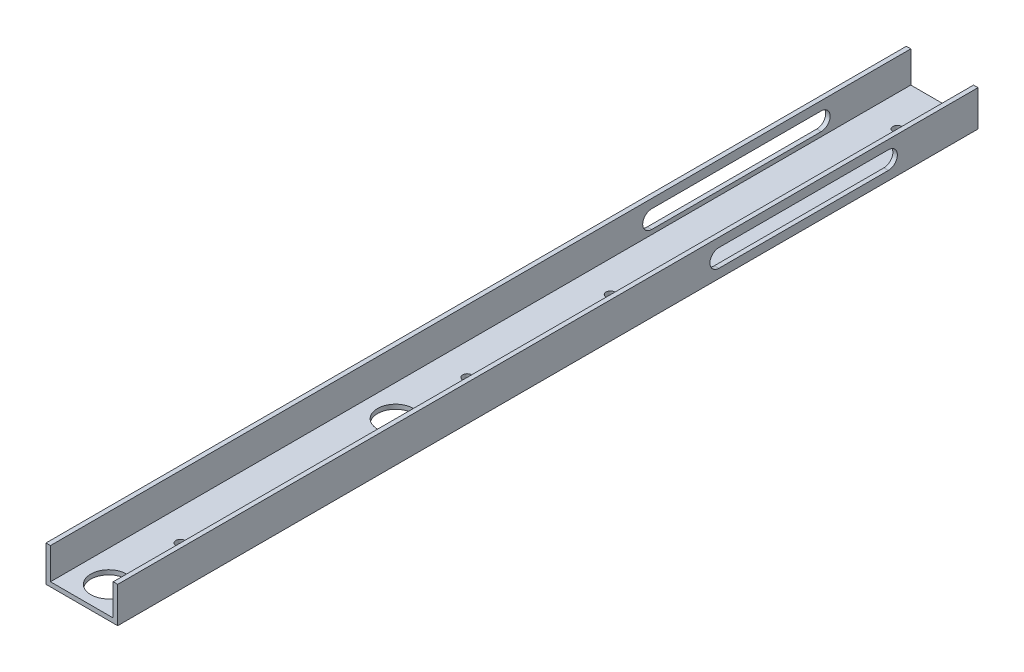
ISO-10303-21;
HEADER;
FILE_DESCRIPTION(('STEP AP214'),'2;1');
FILE_NAME('part.step','',(''),(''),'','','');
FILE_SCHEMA(('AUTOMOTIVE_DESIGN { 1 0 10303 214 1 1 1 1 }'));
ENDSEC;
DATA;
#1=APPLICATION_CONTEXT('core data for automotive mechanical design processes');
#2=APPLICATION_PROTOCOL_DEFINITION('international standard','automotive_design',2000,#1);
#3=PRODUCT_CONTEXT('',#1,'mechanical');
#4=PRODUCT('Part','Part','',(#3));
#5=PRODUCT_RELATED_PRODUCT_CATEGORY('part','',(#4));
#6=PRODUCT_DEFINITION_FORMATION('','',#4);
#7=PRODUCT_DEFINITION_CONTEXT('part definition',#1,'design');
#8=PRODUCT_DEFINITION('design','',#6,#7);
#9=PRODUCT_DEFINITION_SHAPE('','',#8);
#10=(LENGTH_UNIT() NAMED_UNIT(*) SI_UNIT(.MILLI.,.METRE.));
#11=(NAMED_UNIT(*) PLANE_ANGLE_UNIT() SI_UNIT($,.RADIAN.));
#12=(NAMED_UNIT(*) SI_UNIT($,.STERADIAN.) SOLID_ANGLE_UNIT());
#13=UNCERTAINTY_MEASURE_WITH_UNIT(LENGTH_MEASURE(1.E-05),#10,'distance_accuracy_value','');
#14=(GEOMETRIC_REPRESENTATION_CONTEXT(3) GLOBAL_UNCERTAINTY_ASSIGNED_CONTEXT((#13)) GLOBAL_UNIT_ASSIGNED_CONTEXT((#10,
#11,#12)) REPRESENTATION_CONTEXT('',''));
#15=CARTESIAN_POINT('',(0.,0.,0.));
#16=DIRECTION('',(0.,0.,1.));
#17=DIRECTION('',(1.,0.,0.));
#18=AXIS2_PLACEMENT_3D('',#15,#16,#17);
#19=CARTESIAN_POINT('',(0.,0.,609.6));
#20=DIRECTION('',(1.,0.,0.));
#21=DIRECTION('',(0.,0.,-1.));
#22=AXIS2_PLACEMENT_3D('',#19,#20,#21);
#23=PLANE('',#22);
#24=DIRECTION('',(0.,0.,1.));
#25=VECTOR('',#24,1.);
#26=CARTESIAN_POINT('',(0.,19.05,183.606708986));
#27=LINE('',#26,#25);
#28=CARTESIAN_POINT('',(0.,19.05,63.5));
#29=VERTEX_POINT('',#28);
#30=CARTESIAN_POINT('',(0.,19.05,183.606708986));
#31=VERTEX_POINT('',#30);
#32=EDGE_CURVE('E166',#29,#31,#27,.T.);
#33=ORIENTED_EDGE('',*,*,#32,.T.);
#34=CARTESIAN_POINT('',(0.,12.7,183.606708986));
#35=DIRECTION('',(1.,0.,0.));
#36=DIRECTION('',(0.,0.,-1.));
#37=AXIS2_PLACEMENT_3D('',#34,#35,#36);
#38=CIRCLE('',#37,6.35);
#39=CARTESIAN_POINT('',(0.,6.34999999999999,183.606708986));
#40=VERTEX_POINT('',#39);
#41=EDGE_CURVE('E151',#31,#40,#38,.T.);
#42=ORIENTED_EDGE('',*,*,#41,.T.);
#43=DIRECTION('',(0.,0.,-1.));
#44=VECTOR('',#43,1.);
#45=CARTESIAN_POINT('',(0.,6.34999999999999,183.606708986));
#46=LINE('',#45,#44);
#47=CARTESIAN_POINT('',(0.,6.34999999999998,63.5));
#48=VERTEX_POINT('',#47);
#49=EDGE_CURVE('E159',#40,#48,#46,.T.);
#50=ORIENTED_EDGE('',*,*,#49,.T.);
#51=CARTESIAN_POINT('',(0.,12.7,63.5));
#52=DIRECTION('',(1.,0.,0.));
#53=DIRECTION('',(0.,0.,-1.));
#54=AXIS2_PLACEMENT_3D('',#51,#52,#53);
#55=CIRCLE('',#54,6.35);
#56=EDGE_CURVE('E46',#48,#29,#55,.T.);
#57=ORIENTED_EDGE('',*,*,#56,.T.);
#58=EDGE_LOOP('',(#33,#42,#50,#57));
#59=FACE_BOUND('',#58,.T.);
#60=DIRECTION('',(0.,-1.,0.));
#61=VECTOR('',#60,1.);
#62=CARTESIAN_POINT('',(0.,0.,0.));
#63=LINE('',#62,#61);
#64=CARTESIAN_POINT('',(0.,25.4,0.));
#65=VERTEX_POINT('',#64);
#66=CARTESIAN_POINT('',(0.,0.,0.));
#67=VERTEX_POINT('',#66);
#68=EDGE_CURVE('E221',#65,#67,#63,.T.);
#69=ORIENTED_EDGE('',*,*,#68,.T.);
#70=DIRECTION('',(0.,0.,-1.));
#71=VECTOR('',#70,1.);
#72=CARTESIAN_POINT('',(0.,0.,609.6));
#73=LINE('',#72,#71);
#74=CARTESIAN_POINT('',(0.,0.,609.6));
#75=VERTEX_POINT('',#74);
#76=EDGE_CURVE('E292',#75,#67,#73,.T.);
#77=ORIENTED_EDGE('',*,*,#76,.F.);
#78=DIRECTION('',(0.,-1.,0.));
#79=VECTOR('',#78,1.);
#80=CARTESIAN_POINT('',(0.,0.,609.6));
#81=LINE('',#80,#79);
#82=CARTESIAN_POINT('',(0.,25.4,609.6));
#83=VERTEX_POINT('',#82);
#84=EDGE_CURVE('E238',#83,#75,#81,.T.);
#85=ORIENTED_EDGE('',*,*,#84,.F.);
#86=DIRECTION('',(0.,0.,-1.));
#87=VECTOR('',#86,1.);
#88=CARTESIAN_POINT('',(0.,25.4,609.6));
#89=LINE('',#88,#87);
#90=EDGE_CURVE('E256',#83,#65,#89,.T.);
#91=ORIENTED_EDGE('',*,*,#90,.T.);
#92=EDGE_LOOP('',(#69,#77,#85,#91));
#93=FACE_BOUND('',#92,.T.);
#94=ADVANCED_FACE('F32',(#59,#93),#23,.F.);
#95=CARTESIAN_POINT('',(0.,0.,609.6));
#96=DIRECTION('',(0.,1.,0.));
#97=DIRECTION('',(0.,0.,1.));
#98=AXIS2_PLACEMENT_3D('',#95,#96,#97);
#99=PLANE('',#98);
#100=CARTESIAN_POINT('',(25.4,0.,234.95));
#101=DIRECTION('',(0.,1.,0.));
#102=DIRECTION('',(0.,0.,1.));
#103=AXIS2_PLACEMENT_3D('',#100,#101,#102);
#104=CIRCLE('',#103,3.17500000000002);
#105=CARTESIAN_POINT('',(25.4,0.,238.125));
#106=VERTEX_POINT('',#105);
#107=EDGE_CURVE('E205',#106,#106,#104,.F.);
#108=ORIENTED_EDGE('',*,*,#107,.F.);
#109=EDGE_LOOP('',(#108));
#110=FACE_BOUND('',#109,.T.);
#111=CARTESIAN_POINT('',(25.4,0.,31.75));
#112=DIRECTION('',(0.,1.,0.));
#113=DIRECTION('',(0.,0.,1.));
#114=AXIS2_PLACEMENT_3D('',#111,#112,#113);
#115=CIRCLE('',#114,3.175);
#116=CARTESIAN_POINT('',(25.4,0.,34.925));
#117=VERTEX_POINT('',#116);
#118=EDGE_CURVE('E206',#117,#117,#115,.F.);
#119=ORIENTED_EDGE('',*,*,#118,.F.);
#120=EDGE_LOOP('',(#119));
#121=FACE_BOUND('',#120,.T.);
#122=CARTESIAN_POINT('',(25.4,0.,590.55));
#123=DIRECTION('',(0.,1.,0.));
#124=DIRECTION('',(0.,0.,1.));
#125=AXIS2_PLACEMENT_3D('',#122,#123,#124);
#126=CIRCLE('',#125,12.7);
#127=CARTESIAN_POINT('',(25.4,0.,603.25));
#128=VERTEX_POINT('',#127);
#129=EDGE_CURVE('E217',#128,#128,#126,.F.);
#130=ORIENTED_EDGE('',*,*,#129,.F.);
#131=EDGE_LOOP('',(#130));
#132=FACE_BOUND('',#131,.T.);
#133=CARTESIAN_POINT('',(25.4,0.,387.35));
#134=DIRECTION('',(0.,1.,0.));
#135=DIRECTION('',(0.,0.,1.));
#136=AXIS2_PLACEMENT_3D('',#133,#134,#135);
#137=CIRCLE('',#136,12.7);
#138=CARTESIAN_POINT('',(25.4,0.,400.05));
#139=VERTEX_POINT('',#138);
#140=EDGE_CURVE('E218',#139,#139,#137,.F.);
#141=ORIENTED_EDGE('',*,*,#140,.F.);
#142=EDGE_LOOP('',(#141));
#143=FACE_BOUND('',#142,.T.);
#144=CARTESIAN_POINT('',(25.4,0.,539.75));
#145=DIRECTION('',(0.,1.,0.));
#146=DIRECTION('',(0.,0.,1.));
#147=AXIS2_PLACEMENT_3D('',#144,#145,#146);
#148=CIRCLE('',#147,3.17500000000001);
#149=CARTESIAN_POINT('',(25.4,0.,542.925));
#150=VERTEX_POINT('',#149);
#151=EDGE_CURVE('E225',#150,#150,#148,.F.);
#152=ORIENTED_EDGE('',*,*,#151,.F.);
#153=EDGE_LOOP('',(#152));
#154=FACE_BOUND('',#153,.T.);
#155=CARTESIAN_POINT('',(25.4,0.,336.55));
#156=DIRECTION('',(0.,1.,0.));
#157=DIRECTION('',(0.,0.,1.));
#158=AXIS2_PLACEMENT_3D('',#155,#156,#157);
#159=CIRCLE('',#158,3.175);
#160=CARTESIAN_POINT('',(25.4,0.,339.725));
#161=VERTEX_POINT('',#160);
#162=EDGE_CURVE('E231',#161,#161,#159,.F.);
#163=ORIENTED_EDGE('',*,*,#162,.F.);
#164=EDGE_LOOP('',(#163));
#165=FACE_BOUND('',#164,.T.);
#166=DIRECTION('',(1.,0.,0.));
#167=VECTOR('',#166,1.);
#168=CARTESIAN_POINT('',(0.,0.,0.));
#169=LINE('',#168,#167);
#170=CARTESIAN_POINT('',(50.8,0.,0.));
#171=VERTEX_POINT('',#170);
#172=EDGE_CURVE('E259',#67,#171,#169,.T.);
#173=ORIENTED_EDGE('',*,*,#172,.T.);
#174=DIRECTION('',(0.,0.,-1.));
#175=VECTOR('',#174,1.);
#176=CARTESIAN_POINT('',(50.8,0.,609.6));
#177=LINE('',#176,#175);
#178=CARTESIAN_POINT('',(50.8,0.,609.6));
#179=VERTEX_POINT('',#178);
#180=EDGE_CURVE('E289',#179,#171,#177,.T.);
#181=ORIENTED_EDGE('',*,*,#180,.F.);
#182=DIRECTION('',(1.,0.,0.));
#183=VECTOR('',#182,1.);
#184=CARTESIAN_POINT('',(0.,0.,609.6));
#185=LINE('',#184,#183);
#186=EDGE_CURVE('E241',#75,#179,#185,.T.);
#187=ORIENTED_EDGE('',*,*,#186,.F.);
#188=ORIENTED_EDGE('',*,*,#76,.T.);
#189=EDGE_LOOP('',(#173,#181,#187,#188));
#190=FACE_BOUND('',#189,.T.);
#191=ADVANCED_FACE('F321',(#110,#121,#132,#143,#154,#165,#190),#99,.F.);
#192=CARTESIAN_POINT('',(50.8,0.,609.6));
#193=DIRECTION('',(-1.,0.,0.));
#194=DIRECTION('',(0.,0.,1.));
#195=AXIS2_PLACEMENT_3D('',#192,#193,#194);
#196=PLANE('',#195);
#197=DIRECTION('',(0.,0.,-1.));
#198=VECTOR('',#197,1.);
#199=CARTESIAN_POINT('',(50.8,6.34999999999999,183.606708986));
#200=LINE('',#199,#198);
#201=CARTESIAN_POINT('',(50.8,6.34999999999999,183.606708986));
#202=VERTEX_POINT('',#201);
#203=CARTESIAN_POINT('',(50.8,6.34999999999998,63.5));
#204=VERTEX_POINT('',#203);
#205=EDGE_CURVE('E176',#202,#204,#200,.T.);
#206=ORIENTED_EDGE('',*,*,#205,.F.);
#207=CARTESIAN_POINT('',(50.8,12.7,183.606708986));
#208=DIRECTION('',(1.,0.,0.));
#209=DIRECTION('',(0.,0.,-1.));
#210=AXIS2_PLACEMENT_3D('',#207,#208,#209);
#211=CIRCLE('',#210,6.35);
#212=CARTESIAN_POINT('',(50.8,19.05,183.606708986));
#213=VERTEX_POINT('',#212);
#214=EDGE_CURVE('E54',#213,#202,#211,.T.);
#215=ORIENTED_EDGE('',*,*,#214,.F.);
#216=DIRECTION('',(0.,0.,1.));
#217=VECTOR('',#216,1.);
#218=CARTESIAN_POINT('',(50.8,19.05,183.606708986));
#219=LINE('',#218,#217);
#220=CARTESIAN_POINT('',(50.8,19.05,63.5));
#221=VERTEX_POINT('',#220);
#222=EDGE_CURVE('E167',#221,#213,#219,.T.);
#223=ORIENTED_EDGE('',*,*,#222,.F.);
#224=CARTESIAN_POINT('',(50.8,12.7,63.5));
#225=DIRECTION('',(1.,0.,0.));
#226=DIRECTION('',(0.,0.,-1.));
#227=AXIS2_PLACEMENT_3D('',#224,#225,#226);
#228=CIRCLE('',#227,6.35);
#229=EDGE_CURVE('E170',#204,#221,#228,.T.);
#230=ORIENTED_EDGE('',*,*,#229,.F.);
#231=EDGE_LOOP('',(#206,#215,#223,#230));
#232=FACE_BOUND('',#231,.T.);
#233=DIRECTION('',(0.,1.,0.));
#234=VECTOR('',#233,1.);
#235=CARTESIAN_POINT('',(50.8,0.,0.));
#236=LINE('',#235,#234);
#237=CARTESIAN_POINT('',(50.8,25.4,0.));
#238=VERTEX_POINT('',#237);
#239=EDGE_CURVE('E261',#171,#238,#236,.T.);
#240=ORIENTED_EDGE('',*,*,#239,.T.);
#241=DIRECTION('',(0.,0.,-1.));
#242=VECTOR('',#241,1.);
#243=CARTESIAN_POINT('',(50.8,25.4,609.6));
#244=LINE('',#243,#242);
#245=CARTESIAN_POINT('',(50.8,25.4,609.6));
#246=VERTEX_POINT('',#245);
#247=EDGE_CURVE('E286',#246,#238,#244,.T.);
#248=ORIENTED_EDGE('',*,*,#247,.F.);
#249=DIRECTION('',(0.,1.,0.));
#250=VECTOR('',#249,1.);
#251=CARTESIAN_POINT('',(50.8,0.,609.6));
#252=LINE('',#251,#250);
#253=EDGE_CURVE('E244',#179,#246,#252,.T.);
#254=ORIENTED_EDGE('',*,*,#253,.F.);
#255=ORIENTED_EDGE('',*,*,#180,.T.);
#256=EDGE_LOOP('',(#240,#248,#254,#255));
#257=FACE_BOUND('',#256,.T.);
#258=ADVANCED_FACE('F325',(#232,#257),#196,.F.);
#259=CARTESIAN_POINT('',(50.8,25.4,609.6));
#260=DIRECTION('',(0.,-1.,0.));
#261=DIRECTION('',(0.,0.,-1.));
#262=AXIS2_PLACEMENT_3D('',#259,#260,#261);
#263=PLANE('',#262);
#264=DIRECTION('',(-1.,0.,0.));
#265=VECTOR('',#264,1.);
#266=CARTESIAN_POINT('',(50.8,25.4,0.));
#267=LINE('',#266,#265);
#268=CARTESIAN_POINT('',(47.625,25.4,0.));
#269=VERTEX_POINT('',#268);
#270=EDGE_CURVE('E263',#238,#269,#267,.T.);
#271=ORIENTED_EDGE('',*,*,#270,.T.);
#272=DIRECTION('',(0.,0.,-1.));
#273=VECTOR('',#272,1.);
#274=CARTESIAN_POINT('',(47.625,25.4,609.6));
#275=LINE('',#274,#273);
#276=CARTESIAN_POINT('',(47.625,25.4,609.6));
#277=VERTEX_POINT('',#276);
#278=EDGE_CURVE('E283',#277,#269,#275,.T.);
#279=ORIENTED_EDGE('',*,*,#278,.F.);
#280=DIRECTION('',(-1.,0.,0.));
#281=VECTOR('',#280,1.);
#282=CARTESIAN_POINT('',(50.8,25.4,609.6));
#283=LINE('',#282,#281);
#284=EDGE_CURVE('E246',#246,#277,#283,.T.);
#285=ORIENTED_EDGE('',*,*,#284,.F.);
#286=ORIENTED_EDGE('',*,*,#247,.T.);
#287=EDGE_LOOP('',(#271,#279,#285,#286));
#288=FACE_BOUND('',#287,.T.);
#289=ADVANCED_FACE('F330',(#288),#263,.F.);
#290=CARTESIAN_POINT('',(47.625,3.175,609.6));
#291=DIRECTION('',(1.,0.,0.));
#292=DIRECTION('',(0.,0.,-1.));
#293=AXIS2_PLACEMENT_3D('',#290,#291,#292);
#294=PLANE('',#293);
#295=DIRECTION('',(0.,0.,1.));
#296=VECTOR('',#295,1.);
#297=CARTESIAN_POINT('',(47.625,19.05,609.6));
#298=LINE('',#297,#296);
#299=CARTESIAN_POINT('',(47.625,19.05,63.5));
#300=VERTEX_POINT('',#299);
#301=CARTESIAN_POINT('',(47.625,19.05,183.606708986));
#302=VERTEX_POINT('',#301);
#303=EDGE_CURVE('E195',#300,#302,#298,.T.);
#304=ORIENTED_EDGE('',*,*,#303,.T.);
#305=CARTESIAN_POINT('',(47.625,12.7,183.606708986));
#306=DIRECTION('',(1.,0.,0.));
#307=DIRECTION('',(0.,0.,-1.));
#308=AXIS2_PLACEMENT_3D('',#305,#306,#307);
#309=CIRCLE('',#308,6.35);
#310=CARTESIAN_POINT('',(47.625,6.34999999999999,183.606708986));
#311=VERTEX_POINT('',#310);
#312=EDGE_CURVE('E198',#302,#311,#309,.T.);
#313=ORIENTED_EDGE('',*,*,#312,.T.);
#314=DIRECTION('',(0.,0.,-1.));
#315=VECTOR('',#314,1.);
#316=CARTESIAN_POINT('',(47.625,6.35000000000001,609.6));
#317=LINE('',#316,#315);
#318=CARTESIAN_POINT('',(47.625,6.34999999999998,63.5));
#319=VERTEX_POINT('',#318);
#320=EDGE_CURVE('E183',#311,#319,#317,.T.);
#321=ORIENTED_EDGE('',*,*,#320,.T.);
#322=CARTESIAN_POINT('',(47.625,12.7,63.5));
#323=DIRECTION('',(1.,0.,0.));
#324=DIRECTION('',(0.,0.,-1.));
#325=AXIS2_PLACEMENT_3D('',#322,#323,#324);
#326=CIRCLE('',#325,6.35);
#327=EDGE_CURVE('E192',#319,#300,#326,.T.);
#328=ORIENTED_EDGE('',*,*,#327,.T.);
#329=EDGE_LOOP('',(#304,#313,#321,#328));
#330=FACE_BOUND('',#329,.T.);
#331=DIRECTION('',(0.,-1.,0.));
#332=VECTOR('',#331,1.);
#333=CARTESIAN_POINT('',(47.625,3.175,0.));
#334=LINE('',#333,#332);
#335=CARTESIAN_POINT('',(47.625,3.175,0.));
#336=VERTEX_POINT('',#335);
#337=EDGE_CURVE('E265',#269,#336,#334,.T.);
#338=ORIENTED_EDGE('',*,*,#337,.T.);
#339=DIRECTION('',(0.,0.,-1.));
#340=VECTOR('',#339,1.);
#341=CARTESIAN_POINT('',(47.625,3.175,609.6));
#342=LINE('',#341,#340);
#343=CARTESIAN_POINT('',(47.625,3.175,609.6));
#344=VERTEX_POINT('',#343);
#345=EDGE_CURVE('E280',#344,#336,#342,.T.);
#346=ORIENTED_EDGE('',*,*,#345,.F.);
#347=DIRECTION('',(0.,-1.,0.));
#348=VECTOR('',#347,1.);
#349=CARTESIAN_POINT('',(47.625,3.175,609.6));
#350=LINE('',#349,#348);
#351=EDGE_CURVE('E248',#277,#344,#350,.T.);
#352=ORIENTED_EDGE('',*,*,#351,.F.);
#353=ORIENTED_EDGE('',*,*,#278,.T.);
#354=EDGE_LOOP('',(#338,#346,#352,#353));
#355=FACE_BOUND('',#354,.T.);
#356=ADVANCED_FACE('F338',(#330,#355),#294,.F.);
#357=CARTESIAN_POINT('',(3.175,3.175,609.6));
#358=DIRECTION('',(0.,-1.,0.));
#359=DIRECTION('',(0.,0.,-1.));
#360=AXIS2_PLACEMENT_3D('',#357,#358,#359);
#361=PLANE('',#360);
#362=CARTESIAN_POINT('',(25.4,3.175,234.95));
#363=DIRECTION('',(0.,1.,0.));
#364=DIRECTION('',(0.,0.,1.));
#365=AXIS2_PLACEMENT_3D('',#362,#363,#364);
#366=CIRCLE('',#365,3.17500000000002);
#367=CARTESIAN_POINT('',(25.4,3.175,238.125));
#368=VERTEX_POINT('',#367);
#369=EDGE_CURVE('E202',#368,#368,#366,.T.);
#370=ORIENTED_EDGE('',*,*,#369,.F.);
#371=EDGE_LOOP('',(#370));
#372=FACE_BOUND('',#371,.T.);
#373=CARTESIAN_POINT('',(25.4,3.175,31.75));
#374=DIRECTION('',(0.,1.,0.));
#375=DIRECTION('',(0.,0.,1.));
#376=AXIS2_PLACEMENT_3D('',#373,#374,#375);
#377=CIRCLE('',#376,3.175);
#378=CARTESIAN_POINT('',(25.4,3.175,34.925));
#379=VERTEX_POINT('',#378);
#380=EDGE_CURVE('E201',#379,#379,#377,.T.);
#381=ORIENTED_EDGE('',*,*,#380,.F.);
#382=EDGE_LOOP('',(#381));
#383=FACE_BOUND('',#382,.T.);
#384=CARTESIAN_POINT('',(25.4,3.175,590.55));
#385=DIRECTION('',(0.,1.,0.));
#386=DIRECTION('',(0.,0.,1.));
#387=AXIS2_PLACEMENT_3D('',#384,#385,#386);
#388=CIRCLE('',#387,12.7);
#389=CARTESIAN_POINT('',(25.4,3.175,603.25));
#390=VERTEX_POINT('',#389);
#391=EDGE_CURVE('E214',#390,#390,#388,.T.);
#392=ORIENTED_EDGE('',*,*,#391,.F.);
#393=EDGE_LOOP('',(#392));
#394=FACE_BOUND('',#393,.T.);
#395=CARTESIAN_POINT('',(25.4,3.175,387.35));
#396=DIRECTION('',(0.,1.,0.));
#397=DIRECTION('',(0.,0.,1.));
#398=AXIS2_PLACEMENT_3D('',#395,#396,#397);
#399=CIRCLE('',#398,12.7);
#400=CARTESIAN_POINT('',(25.4,3.175,400.05));
#401=VERTEX_POINT('',#400);
#402=EDGE_CURVE('E222',#401,#401,#399,.T.);
#403=ORIENTED_EDGE('',*,*,#402,.F.);
#404=EDGE_LOOP('',(#403));
#405=FACE_BOUND('',#404,.T.);
#406=CARTESIAN_POINT('',(25.4,3.175,539.75));
#407=DIRECTION('',(0.,1.,0.));
#408=DIRECTION('',(0.,0.,1.));
#409=AXIS2_PLACEMENT_3D('',#406,#407,#408);
#410=CIRCLE('',#409,3.17500000000001);
#411=CARTESIAN_POINT('',(25.4,3.175,542.925));
#412=VERTEX_POINT('',#411);
#413=EDGE_CURVE('E228',#412,#412,#410,.T.);
#414=ORIENTED_EDGE('',*,*,#413,.F.);
#415=EDGE_LOOP('',(#414));
#416=FACE_BOUND('',#415,.T.);
#417=CARTESIAN_POINT('',(25.4,3.175,336.55));
#418=DIRECTION('',(0.,1.,0.));
#419=DIRECTION('',(0.,0.,1.));
#420=AXIS2_PLACEMENT_3D('',#417,#418,#419);
#421=CIRCLE('',#420,3.175);
#422=CARTESIAN_POINT('',(25.4,3.175,339.725));
#423=VERTEX_POINT('',#422);
#424=EDGE_CURVE('E209',#423,#423,#421,.T.);
#425=ORIENTED_EDGE('',*,*,#424,.F.);
#426=EDGE_LOOP('',(#425));
#427=FACE_BOUND('',#426,.T.);
#428=DIRECTION('',(-1.,0.,0.));
#429=VECTOR('',#428,1.);
#430=CARTESIAN_POINT('',(3.175,3.175,0.));
#431=LINE('',#430,#429);
#432=CARTESIAN_POINT('',(3.175,3.175,0.));
#433=VERTEX_POINT('',#432);
#434=EDGE_CURVE('E267',#336,#433,#431,.T.);
#435=ORIENTED_EDGE('',*,*,#434,.T.);
#436=DIRECTION('',(0.,0.,-1.));
#437=VECTOR('',#436,1.);
#438=CARTESIAN_POINT('',(3.175,3.175,609.6));
#439=LINE('',#438,#437);
#440=CARTESIAN_POINT('',(3.175,3.175,609.6));
#441=VERTEX_POINT('',#440);
#442=EDGE_CURVE('E277',#441,#433,#439,.T.);
#443=ORIENTED_EDGE('',*,*,#442,.F.);
#444=DIRECTION('',(-1.,0.,0.));
#445=VECTOR('',#444,1.);
#446=CARTESIAN_POINT('',(3.175,3.175,609.6));
#447=LINE('',#446,#445);
#448=EDGE_CURVE('E250',#344,#441,#447,.T.);
#449=ORIENTED_EDGE('',*,*,#448,.F.);
#450=ORIENTED_EDGE('',*,*,#345,.T.);
#451=EDGE_LOOP('',(#435,#443,#449,#450));
#452=FACE_BOUND('',#451,.T.);
#453=ADVANCED_FACE('F342',(#372,#383,#394,#405,#416,#427,#452),#361,.F.);
#454=CARTESIAN_POINT('',(3.175,3.175,609.6));
#455=DIRECTION('',(-1.,0.,0.));
#456=DIRECTION('',(0.,0.,1.));
#457=AXIS2_PLACEMENT_3D('',#454,#455,#456);
#458=PLANE('',#457);
#459=DIRECTION('',(0.,0.,1.));
#460=VECTOR('',#459,1.);
#461=CARTESIAN_POINT('',(3.175,6.35000000000001,609.6));
#462=LINE('',#461,#460);
#463=CARTESIAN_POINT('',(3.175,6.34999999999998,63.5));
#464=VERTEX_POINT('',#463);
#465=CARTESIAN_POINT('',(3.175,6.34999999999999,183.606708986));
#466=VERTEX_POINT('',#465);
#467=EDGE_CURVE('E295',#464,#466,#462,.T.);
#468=ORIENTED_EDGE('',*,*,#467,.T.);
#469=CARTESIAN_POINT('',(3.175,12.7,183.606708986));
#470=DIRECTION('',(-1.,0.,0.));
#471=DIRECTION('',(0.,0.,1.));
#472=AXIS2_PLACEMENT_3D('',#469,#470,#471);
#473=CIRCLE('',#472,6.35);
#474=CARTESIAN_POINT('',(3.175,19.05,183.606708986));
#475=VERTEX_POINT('',#474);
#476=EDGE_CURVE('E11',#466,#475,#473,.T.);
#477=ORIENTED_EDGE('',*,*,#476,.T.);
#478=DIRECTION('',(0.,0.,-1.));
#479=VECTOR('',#478,1.);
#480=CARTESIAN_POINT('',(3.175,19.05,609.6));
#481=LINE('',#480,#479);
#482=CARTESIAN_POINT('',(3.175,19.05,63.5));
#483=VERTEX_POINT('',#482);
#484=EDGE_CURVE('E39',#475,#483,#481,.T.);
#485=ORIENTED_EDGE('',*,*,#484,.T.);
#486=CARTESIAN_POINT('',(3.175,12.7,63.5));
#487=DIRECTION('',(-1.,0.,0.));
#488=DIRECTION('',(0.,0.,1.));
#489=AXIS2_PLACEMENT_3D('',#486,#487,#488);
#490=CIRCLE('',#489,6.35);
#491=EDGE_CURVE('E297',#483,#464,#490,.T.);
#492=ORIENTED_EDGE('',*,*,#491,.T.);
#493=EDGE_LOOP('',(#468,#477,#485,#492));
#494=FACE_BOUND('',#493,.T.);
#495=DIRECTION('',(0.,1.,0.));
#496=VECTOR('',#495,1.);
#497=CARTESIAN_POINT('',(3.175,3.175,0.));
#498=LINE('',#497,#496);
#499=CARTESIAN_POINT('',(3.175,25.4,0.));
#500=VERTEX_POINT('',#499);
#501=EDGE_CURVE('E269',#433,#500,#498,.T.);
#502=ORIENTED_EDGE('',*,*,#501,.T.);
#503=DIRECTION('',(0.,0.,-1.));
#504=VECTOR('',#503,1.);
#505=CARTESIAN_POINT('',(3.175,25.4,609.6));
#506=LINE('',#505,#504);
#507=CARTESIAN_POINT('',(3.175,25.4,609.6));
#508=VERTEX_POINT('',#507);
#509=EDGE_CURVE('E274',#508,#500,#506,.T.);
#510=ORIENTED_EDGE('',*,*,#509,.F.);
#511=DIRECTION('',(0.,1.,0.));
#512=VECTOR('',#511,1.);
#513=CARTESIAN_POINT('',(3.175,3.175,609.6));
#514=LINE('',#513,#512);
#515=EDGE_CURVE('E252',#441,#508,#514,.T.);
#516=ORIENTED_EDGE('',*,*,#515,.F.);
#517=ORIENTED_EDGE('',*,*,#442,.T.);
#518=EDGE_LOOP('',(#502,#510,#516,#517));
#519=FACE_BOUND('',#518,.T.);
#520=ADVANCED_FACE('F301',(#494,#519),#458,.F.);
#521=CARTESIAN_POINT('',(0.,25.4,609.6));
#522=DIRECTION('',(0.,-1.,0.));
#523=DIRECTION('',(0.,0.,-1.));
#524=AXIS2_PLACEMENT_3D('',#521,#522,#523);
#525=PLANE('',#524);
#526=DIRECTION('',(-1.,0.,0.));
#527=VECTOR('',#526,1.);
#528=CARTESIAN_POINT('',(0.,25.4,0.));
#529=LINE('',#528,#527);
#530=EDGE_CURVE('E242',#500,#65,#529,.T.);
#531=ORIENTED_EDGE('',*,*,#530,.T.);
#532=ORIENTED_EDGE('',*,*,#90,.F.);
#533=DIRECTION('',(-1.,0.,0.));
#534=VECTOR('',#533,1.);
#535=CARTESIAN_POINT('',(0.,25.4,609.6));
#536=LINE('',#535,#534);
#537=EDGE_CURVE('E254',#508,#83,#536,.T.);
#538=ORIENTED_EDGE('',*,*,#537,.F.);
#539=ORIENTED_EDGE('',*,*,#509,.T.);
#540=EDGE_LOOP('',(#531,#532,#538,#539));
#541=FACE_BOUND('',#540,.T.);
#542=ADVANCED_FACE('F349',(#541),#525,.F.);
#543=CARTESIAN_POINT('',(0.,0.,609.6));
#544=DIRECTION('',(0.,0.,-1.));
#545=DIRECTION('',(-1.,0.,0.));
#546=AXIS2_PLACEMENT_3D('',#543,#544,#545);
#547=PLANE('',#546);
#548=ORIENTED_EDGE('',*,*,#84,.T.);
#549=ORIENTED_EDGE('',*,*,#186,.T.);
#550=ORIENTED_EDGE('',*,*,#253,.T.);
#551=ORIENTED_EDGE('',*,*,#284,.T.);
#552=ORIENTED_EDGE('',*,*,#351,.T.);
#553=ORIENTED_EDGE('',*,*,#448,.T.);
#554=ORIENTED_EDGE('',*,*,#515,.T.);
#555=ORIENTED_EDGE('',*,*,#537,.T.);
#556=EDGE_LOOP('',(#548,#549,#550,#551,#552,#553,#554,#555));
#557=FACE_BOUND('',#556,.T.);
#558=ADVANCED_FACE('F352',(#557),#547,.F.);
#559=CARTESIAN_POINT('',(0.,0.,0.));
#560=DIRECTION('',(0.,0.,-1.));
#561=DIRECTION('',(-1.,0.,0.));
#562=AXIS2_PLACEMENT_3D('',#559,#560,#561);
#563=PLANE('',#562);
#564=ORIENTED_EDGE('',*,*,#68,.F.);
#565=ORIENTED_EDGE('',*,*,#530,.F.);
#566=ORIENTED_EDGE('',*,*,#501,.F.);
#567=ORIENTED_EDGE('',*,*,#434,.F.);
#568=ORIENTED_EDGE('',*,*,#337,.F.);
#569=ORIENTED_EDGE('',*,*,#270,.F.);
#570=ORIENTED_EDGE('',*,*,#239,.F.);
#571=ORIENTED_EDGE('',*,*,#172,.F.);
#572=EDGE_LOOP('',(#564,#565,#566,#567,#568,#569,#570,#571));
#573=FACE_BOUND('',#572,.T.);
#574=ADVANCED_FACE('F354',(#573),#563,.T.);
#575=CARTESIAN_POINT('',(25.4,-0.00100000000000013,336.55));
#576=DIRECTION('',(0.,1.,0.));
#577=DIRECTION('',(0.,0.,1.));
#578=AXIS2_PLACEMENT_3D('',#575,#576,#577);
#579=CYLINDRICAL_SURFACE('',#578,3.175);
#580=ORIENTED_EDGE('',*,*,#424,.T.);
#581=EDGE_LOOP('',(#580));
#582=FACE_BOUND('',#581,.T.);
#583=ORIENTED_EDGE('',*,*,#162,.T.);
#584=EDGE_LOOP('',(#583));
#585=FACE_BOUND('',#584,.T.);
#586=ADVANCED_FACE('F357',(#582,#585),#579,.F.);
#587=CARTESIAN_POINT('',(25.4,-0.00100000000000013,539.75));
#588=DIRECTION('',(0.,1.,0.));
#589=DIRECTION('',(0.,0.,1.));
#590=AXIS2_PLACEMENT_3D('',#587,#588,#589);
#591=CYLINDRICAL_SURFACE('',#590,3.17500000000001);
#592=ORIENTED_EDGE('',*,*,#413,.T.);
#593=EDGE_LOOP('',(#592));
#594=FACE_BOUND('',#593,.T.);
#595=ORIENTED_EDGE('',*,*,#151,.T.);
#596=EDGE_LOOP('',(#595));
#597=FACE_BOUND('',#596,.T.);
#598=ADVANCED_FACE('F364',(#594,#597),#591,.F.);
#599=CARTESIAN_POINT('',(25.4,-0.00100000000000013,387.35));
#600=DIRECTION('',(0.,1.,0.));
#601=DIRECTION('',(0.,0.,1.));
#602=AXIS2_PLACEMENT_3D('',#599,#600,#601);
#603=CYLINDRICAL_SURFACE('',#602,12.7);
#604=ORIENTED_EDGE('',*,*,#402,.T.);
#605=EDGE_LOOP('',(#604));
#606=FACE_BOUND('',#605,.T.);
#607=ORIENTED_EDGE('',*,*,#140,.T.);
#608=EDGE_LOOP('',(#607));
#609=FACE_BOUND('',#608,.T.);
#610=ADVANCED_FACE('F368',(#606,#609),#603,.F.);
#611=CARTESIAN_POINT('',(25.4,-0.00100000000000013,590.55));
#612=DIRECTION('',(0.,1.,0.));
#613=DIRECTION('',(0.,0.,1.));
#614=AXIS2_PLACEMENT_3D('',#611,#612,#613);
#615=CYLINDRICAL_SURFACE('',#614,12.7);
#616=ORIENTED_EDGE('',*,*,#391,.T.);
#617=EDGE_LOOP('',(#616));
#618=FACE_BOUND('',#617,.T.);
#619=ORIENTED_EDGE('',*,*,#129,.T.);
#620=EDGE_LOOP('',(#619));
#621=FACE_BOUND('',#620,.T.);
#622=ADVANCED_FACE('F372',(#618,#621),#615,.F.);
#623=CARTESIAN_POINT('',(25.4,-0.00100000000000013,31.75));
#624=DIRECTION('',(0.,1.,0.));
#625=DIRECTION('',(0.,0.,1.));
#626=AXIS2_PLACEMENT_3D('',#623,#624,#625);
#627=CYLINDRICAL_SURFACE('',#626,3.175);
#628=ORIENTED_EDGE('',*,*,#380,.T.);
#629=EDGE_LOOP('',(#628));
#630=FACE_BOUND('',#629,.T.);
#631=ORIENTED_EDGE('',*,*,#118,.T.);
#632=EDGE_LOOP('',(#631));
#633=FACE_BOUND('',#632,.T.);
#634=ADVANCED_FACE('F376',(#630,#633),#627,.F.);
#635=CARTESIAN_POINT('',(25.4,-0.00100000000000013,234.95));
#636=DIRECTION('',(0.,1.,0.));
#637=DIRECTION('',(0.,0.,1.));
#638=AXIS2_PLACEMENT_3D('',#635,#636,#637);
#639=CYLINDRICAL_SURFACE('',#638,3.17500000000002);
#640=ORIENTED_EDGE('',*,*,#369,.T.);
#641=EDGE_LOOP('',(#640));
#642=FACE_BOUND('',#641,.T.);
#643=ORIENTED_EDGE('',*,*,#107,.T.);
#644=EDGE_LOOP('',(#643));
#645=FACE_BOUND('',#644,.T.);
#646=ADVANCED_FACE('F315',(#642,#645),#639,.F.);
#647=CARTESIAN_POINT('',(0.,6.34999999999999,183.606708986));
#648=DIRECTION('',(0.,-1.,0.));
#649=DIRECTION('',(0.,0.,-1.));
#650=AXIS2_PLACEMENT_3D('',#647,#648,#649);
#651=PLANE('',#650);
#652=DIRECTION('',(1.,0.,0.));
#653=VECTOR('',#652,1.);
#654=CARTESIAN_POINT('',(0.,6.34999999999998,63.5));
#655=LINE('',#654,#653);
#656=EDGE_CURVE('E161',#48,#464,#655,.T.);
#657=ORIENTED_EDGE('',*,*,#656,.F.);
#658=ORIENTED_EDGE('',*,*,#49,.F.);
#659=DIRECTION('',(1.,0.,0.));
#660=VECTOR('',#659,1.);
#661=CARTESIAN_POINT('',(0.,6.34999999999999,183.606708986));
#662=LINE('',#661,#660);
#663=EDGE_CURVE('E146',#40,#466,#662,.T.);
#664=ORIENTED_EDGE('',*,*,#663,.T.);
#665=ORIENTED_EDGE('',*,*,#467,.F.);
#666=EDGE_LOOP('',(#657,#658,#664,#665));
#667=FACE_BOUND('',#666,.T.);
#668=ADVANCED_FACE('F160',(#667),#651,.F.);
#669=CARTESIAN_POINT('',(0.,12.7,63.5));
#670=DIRECTION('',(1.,0.,0.));
#671=DIRECTION('',(0.,0.,-1.));
#672=AXIS2_PLACEMENT_3D('',#669,#670,#671);
#673=CYLINDRICAL_SURFACE('',#672,6.35);
#674=DIRECTION('',(1.,0.,0.));
#675=VECTOR('',#674,1.);
#676=CARTESIAN_POINT('',(0.,19.05,63.5));
#677=LINE('',#676,#675);
#678=EDGE_CURVE('E185',#29,#483,#677,.T.);
#679=ORIENTED_EDGE('',*,*,#678,.F.);
#680=ORIENTED_EDGE('',*,*,#56,.F.);
#681=ORIENTED_EDGE('',*,*,#656,.T.);
#682=ORIENTED_EDGE('',*,*,#491,.F.);
#683=EDGE_LOOP('',(#679,#680,#681,#682));
#684=FACE_BOUND('',#683,.T.);
#685=ADVANCED_FACE('F305',(#684),#673,.F.);
#686=CARTESIAN_POINT('',(0.,19.05,183.606708986));
#687=DIRECTION('',(0.,1.,0.));
#688=DIRECTION('',(0.,0.,1.));
#689=AXIS2_PLACEMENT_3D('',#686,#687,#688);
#690=PLANE('',#689);
#691=DIRECTION('',(1.,0.,0.));
#692=VECTOR('',#691,1.);
#693=CARTESIAN_POINT('',(0.,19.05,183.606708986));
#694=LINE('',#693,#692);
#695=EDGE_CURVE('E181',#31,#475,#694,.T.);
#696=ORIENTED_EDGE('',*,*,#695,.F.);
#697=ORIENTED_EDGE('',*,*,#32,.F.);
#698=ORIENTED_EDGE('',*,*,#678,.T.);
#699=ORIENTED_EDGE('',*,*,#484,.F.);
#700=EDGE_LOOP('',(#696,#697,#698,#699));
#701=FACE_BOUND('',#700,.T.);
#702=ADVANCED_FACE('F304',(#701),#690,.F.);
#703=CARTESIAN_POINT('',(0.,12.7,183.606708986));
#704=DIRECTION('',(1.,0.,0.));
#705=DIRECTION('',(0.,0.,-1.));
#706=AXIS2_PLACEMENT_3D('',#703,#704,#705);
#707=CYLINDRICAL_SURFACE('',#706,6.35);
#708=ORIENTED_EDGE('',*,*,#663,.F.);
#709=ORIENTED_EDGE('',*,*,#41,.F.);
#710=ORIENTED_EDGE('',*,*,#695,.T.);
#711=ORIENTED_EDGE('',*,*,#476,.F.);
#712=EDGE_LOOP('',(#708,#709,#710,#711));
#713=FACE_BOUND('',#712,.T.);
#714=ADVANCED_FACE('F148',(#713),#707,.F.);
#715=EDGE_CURVE('E184',#302,#213,#694,.T.);
#716=ORIENTED_EDGE('',*,*,#715,.T.);
#717=ORIENTED_EDGE('',*,*,#214,.T.);
#718=EDGE_CURVE('E156',#311,#202,#662,.T.);
#719=ORIENTED_EDGE('',*,*,#718,.F.);
#720=ORIENTED_EDGE('',*,*,#312,.F.);
#721=EDGE_LOOP('',(#716,#717,#719,#720));
#722=FACE_BOUND('',#721,.T.);
#723=ADVANCED_FACE('F384',(#722),#707,.F.);
#724=EDGE_CURVE('E188',#300,#221,#677,.T.);
#725=ORIENTED_EDGE('',*,*,#724,.T.);
#726=ORIENTED_EDGE('',*,*,#222,.T.);
#727=ORIENTED_EDGE('',*,*,#715,.F.);
#728=ORIENTED_EDGE('',*,*,#303,.F.);
#729=EDGE_LOOP('',(#725,#726,#727,#728));
#730=FACE_BOUND('',#729,.T.);
#731=ADVANCED_FACE('F314',(#730),#690,.F.);
#732=EDGE_CURVE('E155',#319,#204,#655,.T.);
#733=ORIENTED_EDGE('',*,*,#732,.T.);
#734=ORIENTED_EDGE('',*,*,#229,.T.);
#735=ORIENTED_EDGE('',*,*,#724,.F.);
#736=ORIENTED_EDGE('',*,*,#327,.F.);
#737=EDGE_LOOP('',(#733,#734,#735,#736));
#738=FACE_BOUND('',#737,.T.);
#739=ADVANCED_FACE('F308',(#738),#673,.F.);
#740=ORIENTED_EDGE('',*,*,#718,.T.);
#741=ORIENTED_EDGE('',*,*,#205,.T.);
#742=ORIENTED_EDGE('',*,*,#732,.F.);
#743=ORIENTED_EDGE('',*,*,#320,.F.);
#744=EDGE_LOOP('',(#740,#741,#742,#743));
#745=FACE_BOUND('',#744,.T.);
#746=ADVANCED_FACE('F317',(#745),#651,.F.);
#747=CLOSED_SHELL('',(#94,#191,#258,#289,#356,#453,#520,#542,#558,#574,#586,#598,#610,#622,#634,
#646,#668,#685,#702,#714,#723,#731,#739,#746));
#748=MANIFOLD_SOLID_BREP('B2',#747);
#749=ADVANCED_BREP_SHAPE_REPRESENTATION('',(#18,#748),#14);
#750=SHAPE_DEFINITION_REPRESENTATION(#9,#749);
ENDSEC;
END-ISO-10303-21;
